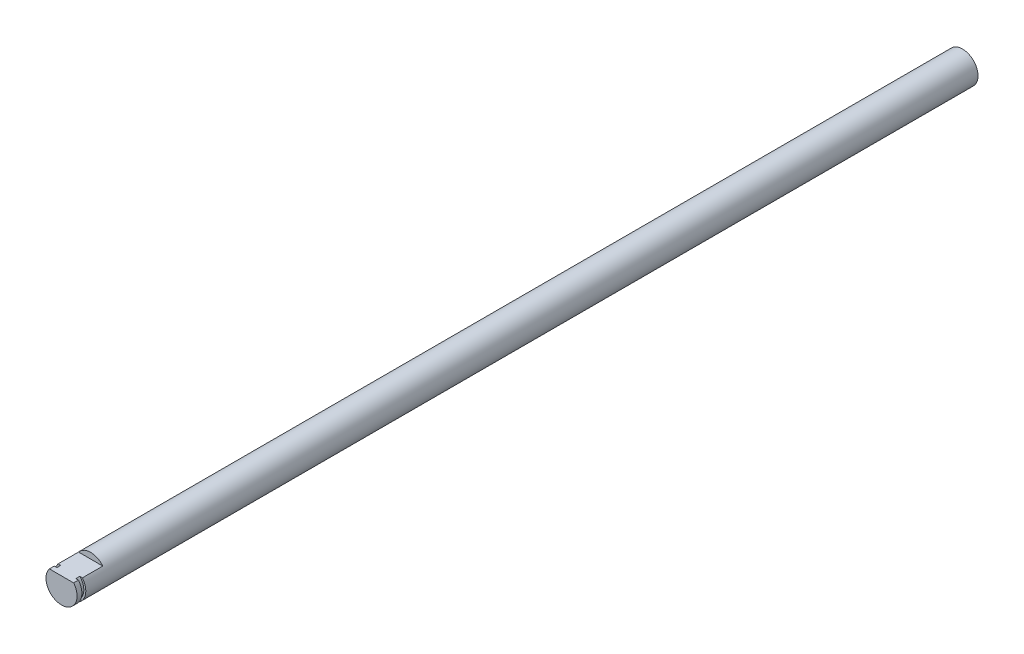
ISO-10303-21;
HEADER;
FILE_DESCRIPTION(('STEP AP214'),'2;1');
FILE_NAME('part.step','',(''),(''),'','','');
FILE_SCHEMA(('AUTOMOTIVE_DESIGN { 1 0 10303 214 1 1 1 1 }'));
ENDSEC;
DATA;
#1=APPLICATION_CONTEXT('core data for automotive mechanical design processes');
#2=APPLICATION_PROTOCOL_DEFINITION('international standard','automotive_design',2000,#1);
#3=PRODUCT_CONTEXT('',#1,'mechanical');
#4=PRODUCT('Part','Part','',(#3));
#5=PRODUCT_RELATED_PRODUCT_CATEGORY('part','',(#4));
#6=PRODUCT_DEFINITION_FORMATION('','',#4);
#7=PRODUCT_DEFINITION_CONTEXT('part definition',#1,'design');
#8=PRODUCT_DEFINITION('design','',#6,#7);
#9=PRODUCT_DEFINITION_SHAPE('','',#8);
#10=(LENGTH_UNIT() NAMED_UNIT(*) SI_UNIT(.MILLI.,.METRE.));
#11=(NAMED_UNIT(*) PLANE_ANGLE_UNIT() SI_UNIT($,.RADIAN.));
#12=(NAMED_UNIT(*) SI_UNIT($,.STERADIAN.) SOLID_ANGLE_UNIT());
#13=UNCERTAINTY_MEASURE_WITH_UNIT(LENGTH_MEASURE(1.E-05),#10,'distance_accuracy_value','');
#14=(GEOMETRIC_REPRESENTATION_CONTEXT(3) GLOBAL_UNCERTAINTY_ASSIGNED_CONTEXT((#13)) GLOBAL_UNIT_ASSIGNED_CONTEXT((#10,
#11,#12)) REPRESENTATION_CONTEXT('',''));
#15=CARTESIAN_POINT('',(0.,0.,0.));
#16=DIRECTION('',(0.,0.,1.));
#17=DIRECTION('',(1.,0.,0.));
#18=AXIS2_PLACEMENT_3D('',#15,#16,#17);
#19=CARTESIAN_POINT('',(0.,0.,325.));
#20=DIRECTION('',(0.,0.,-1.));
#21=DIRECTION('',(-1.,0.,0.));
#22=AXIS2_PLACEMENT_3D('',#19,#20,#21);
#23=CYLINDRICAL_SURFACE('',#22,4.);
#24=CARTESIAN_POINT('',(0.,0.,322.75));
#25=DIRECTION('',(0.,0.,1.));
#26=DIRECTION('',(1.,0.,0.));
#27=AXIS2_PLACEMENT_3D('',#24,#25,#26);
#28=CIRCLE('',#27,4.);
#29=CARTESIAN_POINT('',(-3.1224989991992,2.5,322.75));
#30=VERTEX_POINT('',#29);
#31=CARTESIAN_POINT('',(3.1224989991992,2.5,322.75));
#32=VERTEX_POINT('',#31);
#33=EDGE_CURVE('E114',#30,#32,#28,.T.);
#34=ORIENTED_EDGE('',*,*,#33,.F.);
#35=DIRECTION('',(0.,0.,1.));
#36=VECTOR('',#35,1.);
#37=CARTESIAN_POINT('',(-3.1224989991992,2.5,317.5));
#38=LINE('',#37,#36);
#39=CARTESIAN_POINT('',(-3.1224989991992,2.5,317.5));
#40=VERTEX_POINT('',#39);
#41=EDGE_CURVE('E133',#40,#30,#38,.T.);
#42=ORIENTED_EDGE('',*,*,#41,.F.);
#43=CARTESIAN_POINT('',(0.,0.,317.5));
#44=DIRECTION('',(0.,0.,1.));
#45=DIRECTION('',(1.,0.,0.));
#46=AXIS2_PLACEMENT_3D('',#43,#44,#45);
#47=CIRCLE('',#46,4.);
#48=CARTESIAN_POINT('',(3.1224989991992,2.5,317.5));
#49=VERTEX_POINT('',#48);
#50=EDGE_CURVE('E140',#49,#40,#47,.T.);
#51=ORIENTED_EDGE('',*,*,#50,.F.);
#52=DIRECTION('',(0.,0.,1.));
#53=VECTOR('',#52,1.);
#54=CARTESIAN_POINT('',(3.1224989991992,2.5,317.5));
#55=LINE('',#54,#53);
#56=EDGE_CURVE('E132',#49,#32,#55,.T.);
#57=ORIENTED_EDGE('',*,*,#56,.T.);
#58=EDGE_LOOP('',(#34,#42,#51,#57));
#59=FACE_BOUND('',#58,.T.);
#60=CARTESIAN_POINT('',(0.,0.,93.));
#61=DIRECTION('',(0.,0.,-1.));
#62=DIRECTION('',(-1.,0.,0.));
#63=AXIS2_PLACEMENT_3D('',#60,#61,#62);
#64=CIRCLE('',#63,4.);
#65=CARTESIAN_POINT('',(-4.,0.,93.));
#66=VERTEX_POINT('',#65);
#67=EDGE_CURVE('E148',#66,#66,#64,.T.);
#68=ORIENTED_EDGE('',*,*,#67,.F.);
#69=EDGE_LOOP('',(#68));
#70=FACE_BOUND('',#69,.T.);
#71=ADVANCED_FACE('F53',(#59,#70),#23,.T.);
#72=CARTESIAN_POINT('',(3.1224989991992,2.5,317.5));
#73=DIRECTION('',(0.,-1.,0.));
#74=DIRECTION('',(0.,0.,-1.));
#75=AXIS2_PLACEMENT_3D('',#72,#73,#74);
#76=PLANE('',#75);
#77=DIRECTION('',(-1.,0.,0.));
#78=VECTOR('',#77,1.);
#79=CARTESIAN_POINT('',(3.1224989991992,2.5,322.75));
#80=LINE('',#79,#78);
#81=CARTESIAN_POINT('',(2.44948974278318,2.5,322.75));
#82=VERTEX_POINT('',#81);
#83=EDGE_CURVE('E13',#32,#82,#80,.T.);
#84=ORIENTED_EDGE('',*,*,#83,.F.);
#85=ORIENTED_EDGE('',*,*,#56,.F.);
#86=DIRECTION('',(1.,0.,0.));
#87=VECTOR('',#86,1.);
#88=CARTESIAN_POINT('',(3.1224989991992,2.5,317.5));
#89=LINE('',#88,#87);
#90=EDGE_CURVE('E141',#40,#49,#89,.T.);
#91=ORIENTED_EDGE('',*,*,#90,.F.);
#92=ORIENTED_EDGE('',*,*,#41,.T.);
#93=CARTESIAN_POINT('',(-2.44948974278318,2.5,322.75));
#94=VERTEX_POINT('',#93);
#95=EDGE_CURVE('E63',#94,#30,#80,.T.);
#96=ORIENTED_EDGE('',*,*,#95,.F.);
#97=DIRECTION('',(0.,0.,1.));
#98=VECTOR('',#97,1.);
#99=CARTESIAN_POINT('',(-2.44948974278318,2.5,322.75));
#100=LINE('',#99,#98);
#101=CARTESIAN_POINT('',(-2.44948974278318,2.5,323.75));
#102=VERTEX_POINT('',#101);
#103=EDGE_CURVE('E119',#102,#94,#100,.F.);
#104=ORIENTED_EDGE('',*,*,#103,.F.);
#105=DIRECTION('',(-1.,0.,0.));
#106=VECTOR('',#105,1.);
#107=CARTESIAN_POINT('',(3.1224989991992,2.5,323.75));
#108=LINE('',#107,#106);
#109=CARTESIAN_POINT('',(-3.1224989991992,2.5,323.75));
#110=VERTEX_POINT('',#109);
#111=EDGE_CURVE('E126',#102,#110,#108,.T.);
#112=ORIENTED_EDGE('',*,*,#111,.T.);
#113=CARTESIAN_POINT('',(-3.1224989991992,2.5,325.));
#114=VERTEX_POINT('',#113);
#115=EDGE_CURVE('E78',#110,#114,#38,.T.);
#116=ORIENTED_EDGE('',*,*,#115,.T.);
#117=DIRECTION('',(1.,0.,0.));
#118=VECTOR('',#117,1.);
#119=CARTESIAN_POINT('',(3.1224989991992,2.5,325.));
#120=LINE('',#119,#118);
#121=CARTESIAN_POINT('',(3.1224989991992,2.5,325.));
#122=VERTEX_POINT('',#121);
#123=EDGE_CURVE('E138',#114,#122,#120,.T.);
#124=ORIENTED_EDGE('',*,*,#123,.T.);
#125=CARTESIAN_POINT('',(3.1224989991992,2.5,323.75));
#126=VERTEX_POINT('',#125);
#127=EDGE_CURVE('E136',#126,#122,#55,.T.);
#128=ORIENTED_EDGE('',*,*,#127,.F.);
#129=CARTESIAN_POINT('',(2.44948974278318,2.5,323.75));
#130=VERTEX_POINT('',#129);
#131=EDGE_CURVE('E62',#126,#130,#108,.T.);
#132=ORIENTED_EDGE('',*,*,#131,.T.);
#133=DIRECTION('',(0.,0.,1.));
#134=VECTOR('',#133,1.);
#135=CARTESIAN_POINT('',(2.44948974278318,2.5,322.75));
#136=LINE('',#135,#134);
#137=EDGE_CURVE('E57',#82,#130,#136,.T.);
#138=ORIENTED_EDGE('',*,*,#137,.F.);
#139=EDGE_LOOP('',(#84,#85,#91,#92,#96,#104,#112,#116,#124,#128,#132,#138));
#140=FACE_BOUND('',#139,.T.);
#141=ADVANCED_FACE('F123',(#140),#76,.F.);
#142=ORIENTED_EDGE('',*,*,#115,.F.);
#143=CARTESIAN_POINT('',(0.,0.,323.75));
#144=DIRECTION('',(0.,0.,1.));
#145=DIRECTION('',(1.,0.,0.));
#146=AXIS2_PLACEMENT_3D('',#143,#144,#145);
#147=CIRCLE('',#146,4.);
#148=EDGE_CURVE('E120',#110,#126,#147,.T.);
#149=ORIENTED_EDGE('',*,*,#148,.T.);
#150=ORIENTED_EDGE('',*,*,#127,.T.);
#151=CARTESIAN_POINT('',(0.,0.,325.));
#152=DIRECTION('',(0.,0.,1.));
#153=DIRECTION('',(1.,0.,0.));
#154=AXIS2_PLACEMENT_3D('',#151,#152,#153);
#155=CIRCLE('',#154,4.);
#156=EDGE_CURVE('E129',#114,#122,#155,.T.);
#157=ORIENTED_EDGE('',*,*,#156,.F.);
#158=EDGE_LOOP('',(#142,#149,#150,#157));
#159=FACE_BOUND('',#158,.T.);
#160=ADVANCED_FACE('F55',(#159),#23,.T.);
#161=CARTESIAN_POINT('',(0.,0.,325.));
#162=DIRECTION('',(0.,0.,1.));
#163=DIRECTION('',(1.,0.,0.));
#164=AXIS2_PLACEMENT_3D('',#161,#162,#163);
#165=PLANE('',#164);
#166=ORIENTED_EDGE('',*,*,#123,.F.);
#167=ORIENTED_EDGE('',*,*,#156,.T.);
#168=EDGE_LOOP('',(#166,#167));
#169=FACE_BOUND('',#168,.T.);
#170=ADVANCED_FACE('F164',(#169),#165,.T.);
#171=CARTESIAN_POINT('',(0.,0.,317.5));
#172=DIRECTION('',(0.,0.,1.));
#173=DIRECTION('',(1.,0.,0.));
#174=AXIS2_PLACEMENT_3D('',#171,#172,#173);
#175=PLANE('',#174);
#176=ORIENTED_EDGE('',*,*,#50,.T.);
#177=ORIENTED_EDGE('',*,*,#90,.T.);
#178=EDGE_LOOP('',(#176,#177));
#179=FACE_BOUND('',#178,.T.);
#180=ADVANCED_FACE('F169',(#179),#175,.T.);
#181=CARTESIAN_POINT('',(0.,0.,322.75));
#182=DIRECTION('',(0.,0.,1.));
#183=DIRECTION('',(1.,0.,0.));
#184=AXIS2_PLACEMENT_3D('',#181,#182,#183);
#185=PLANE('',#184);
#186=ORIENTED_EDGE('',*,*,#83,.T.);
#187=CARTESIAN_POINT('',(0.,0.,322.75));
#188=DIRECTION('',(0.,0.,1.));
#189=DIRECTION('',(1.,0.,0.));
#190=AXIS2_PLACEMENT_3D('',#187,#188,#189);
#191=CIRCLE('',#190,3.5);
#192=EDGE_CURVE('E111',#94,#82,#191,.T.);
#193=ORIENTED_EDGE('',*,*,#192,.F.);
#194=ORIENTED_EDGE('',*,*,#95,.T.);
#195=ORIENTED_EDGE('',*,*,#33,.T.);
#196=EDGE_LOOP('',(#186,#193,#194,#195));
#197=FACE_BOUND('',#196,.T.);
#198=ADVANCED_FACE('F110',(#197),#185,.T.);
#199=CARTESIAN_POINT('',(0.,0.,323.75));
#200=DIRECTION('',(0.,0.,1.));
#201=DIRECTION('',(1.,0.,0.));
#202=AXIS2_PLACEMENT_3D('',#199,#200,#201);
#203=PLANE('',#202);
#204=ORIENTED_EDGE('',*,*,#148,.F.);
#205=ORIENTED_EDGE('',*,*,#111,.F.);
#206=CARTESIAN_POINT('',(0.,0.,323.75));
#207=DIRECTION('',(0.,0.,1.));
#208=DIRECTION('',(1.,0.,0.));
#209=AXIS2_PLACEMENT_3D('',#206,#207,#208);
#210=CIRCLE('',#209,3.5);
#211=EDGE_CURVE('E70',#102,#130,#210,.T.);
#212=ORIENTED_EDGE('',*,*,#211,.T.);
#213=ORIENTED_EDGE('',*,*,#131,.F.);
#214=EDGE_LOOP('',(#204,#205,#212,#213));
#215=FACE_BOUND('',#214,.T.);
#216=ADVANCED_FACE('F173',(#215),#203,.F.);
#217=CARTESIAN_POINT('',(0.,0.,322.75));
#218=DIRECTION('',(0.,0.,1.));
#219=DIRECTION('',(1.,0.,0.));
#220=AXIS2_PLACEMENT_3D('',#217,#218,#219);
#221=CYLINDRICAL_SURFACE('',#220,3.5);
#222=ORIENTED_EDGE('',*,*,#137,.T.);
#223=ORIENTED_EDGE('',*,*,#211,.F.);
#224=ORIENTED_EDGE('',*,*,#103,.T.);
#225=ORIENTED_EDGE('',*,*,#192,.T.);
#226=EDGE_LOOP('',(#222,#223,#224,#225));
#227=FACE_BOUND('',#226,.T.);
#228=ADVANCED_FACE('F117',(#227),#221,.T.);
#229=CARTESIAN_POINT('',(0.,0.,93.));
#230=DIRECTION('',(0.,0.,-1.));
#231=DIRECTION('',(-1.,0.,0.));
#232=AXIS2_PLACEMENT_3D('',#229,#230,#231);
#233=PLANE('',#232);
#234=ORIENTED_EDGE('',*,*,#67,.T.);
#235=EDGE_LOOP('',(#234));
#236=FACE_BOUND('',#235,.T.);
#237=ADVANCED_FACE('F153',(#236),#233,.T.);
#238=CLOSED_SHELL('',(#71,#141,#160,#170,#180,#198,#216,#228,#237));
#239=MANIFOLD_SOLID_BREP('B2',#238);
#240=ADVANCED_BREP_SHAPE_REPRESENTATION('',(#18,#239),#14);
#241=SHAPE_DEFINITION_REPRESENTATION(#9,#240);
ENDSEC;
END-ISO-10303-21;
